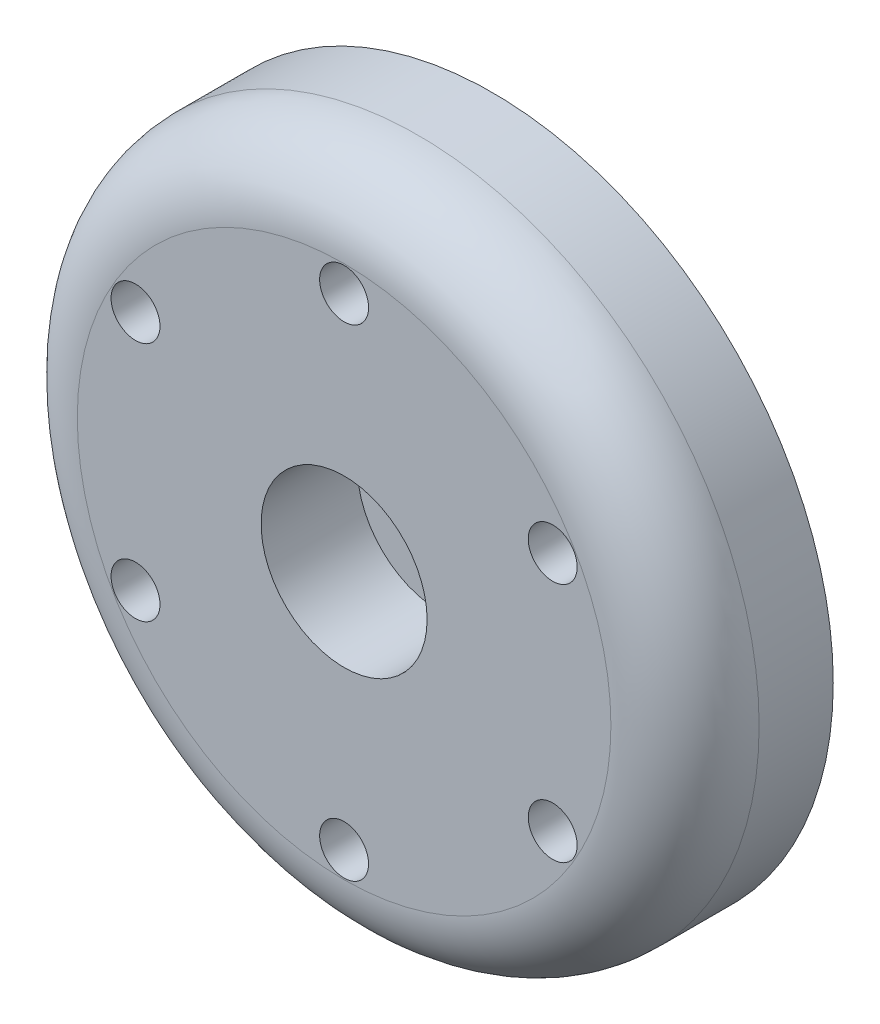
ISO-10303-21;
HEADER;
FILE_DESCRIPTION(('STEP AP214'),'2;1');
FILE_NAME('part.step','',(''),(''),'','','');
FILE_SCHEMA(('AUTOMOTIVE_DESIGN { 1 0 10303 214 1 1 1 1 }'));
ENDSEC;
DATA;
#1=APPLICATION_CONTEXT('core data for automotive mechanical design processes');
#2=APPLICATION_PROTOCOL_DEFINITION('international standard','automotive_design',2000,#1);
#3=PRODUCT_CONTEXT('',#1,'mechanical');
#4=PRODUCT('Part','Part','',(#3));
#5=PRODUCT_RELATED_PRODUCT_CATEGORY('part','',(#4));
#6=PRODUCT_DEFINITION_FORMATION('','',#4);
#7=PRODUCT_DEFINITION_CONTEXT('part definition',#1,'design');
#8=PRODUCT_DEFINITION('design','',#6,#7);
#9=PRODUCT_DEFINITION_SHAPE('','',#8);
#10=(LENGTH_UNIT() NAMED_UNIT(*) SI_UNIT(.MILLI.,.METRE.));
#11=(NAMED_UNIT(*) PLANE_ANGLE_UNIT() SI_UNIT($,.RADIAN.));
#12=(NAMED_UNIT(*) SI_UNIT($,.STERADIAN.) SOLID_ANGLE_UNIT());
#13=UNCERTAINTY_MEASURE_WITH_UNIT(LENGTH_MEASURE(1.E-05),#10,'distance_accuracy_value','');
#14=(GEOMETRIC_REPRESENTATION_CONTEXT(3) GLOBAL_UNCERTAINTY_ASSIGNED_CONTEXT((#13)) GLOBAL_UNIT_ASSIGNED_CONTEXT((#10,
#11,#12)) REPRESENTATION_CONTEXT('',''));
#15=CARTESIAN_POINT('',(0.,0.,0.));
#16=DIRECTION('',(0.,0.,1.));
#17=DIRECTION('',(1.,0.,0.));
#18=AXIS2_PLACEMENT_3D('',#15,#16,#17);
#19=CARTESIAN_POINT('',(0.,0.,10.));
#20=DIRECTION('',(0.,0.,-1.));
#21=DIRECTION('',(-1.,0.,0.));
#22=AXIS2_PLACEMENT_3D('',#19,#20,#21);
#23=CYLINDRICAL_SURFACE('',#22,23.);
#24=CARTESIAN_POINT('',(0.,0.,5.));
#25=DIRECTION('',(0.,0.,1.));
#26=DIRECTION('',(1.,0.,0.));
#27=AXIS2_PLACEMENT_3D('',#24,#25,#26);
#28=CIRCLE('',#27,23.);
#29=CARTESIAN_POINT('',(23.,0.,5.));
#30=VERTEX_POINT('',#29);
#31=EDGE_CURVE('E37',#30,#30,#28,.F.);
#32=ORIENTED_EDGE('',*,*,#31,.T.);
#33=EDGE_LOOP('',(#32));
#34=FACE_BOUND('',#33,.T.);
#35=CARTESIAN_POINT('',(0.,0.,0.));
#36=DIRECTION('',(0.,0.,-1.));
#37=DIRECTION('',(-1.,0.,0.));
#38=AXIS2_PLACEMENT_3D('',#35,#36,#37);
#39=CIRCLE('',#38,23.);
#40=CARTESIAN_POINT('',(-23.,0.,0.));
#41=VERTEX_POINT('',#40);
#42=EDGE_CURVE('E41',#41,#41,#39,.T.);
#43=ORIENTED_EDGE('',*,*,#42,.F.);
#44=EDGE_LOOP('',(#43));
#45=FACE_BOUND('',#44,.T.);
#46=ADVANCED_FACE('F30',(#34,#45),#23,.T.);
#47=CARTESIAN_POINT('',(23.,0.,10.));
#48=DIRECTION('',(0.,0.,1.));
#49=DIRECTION('',(1.,0.,0.));
#50=AXIS2_PLACEMENT_3D('',#47,#48,#49);
#51=PLANE('',#50);
#52=CARTESIAN_POINT('',(0.,0.,10.));
#53=DIRECTION('',(0.,0.,1.));
#54=DIRECTION('',(1.,0.,0.));
#55=AXIS2_PLACEMENT_3D('',#52,#53,#54);
#56=CIRCLE('',#55,18.);
#57=CARTESIAN_POINT('',(18.,0.,10.));
#58=VERTEX_POINT('',#57);
#59=EDGE_CURVE('E10',#58,#58,#56,.T.);
#60=ORIENTED_EDGE('',*,*,#59,.T.);
#61=EDGE_LOOP('',(#60));
#62=FACE_BOUND('',#61,.T.);
#63=CARTESIAN_POINT('',(0.,0.,10.));
#64=DIRECTION('',(0.,0.,1.));
#65=DIRECTION('',(1.,0.,0.));
#66=AXIS2_PLACEMENT_3D('',#63,#64,#65);
#67=CIRCLE('',#66,5.59999999999999);
#68=CARTESIAN_POINT('',(5.59999999999999,0.,10.));
#69=VERTEX_POINT('',#68);
#70=EDGE_CURVE('E104',#69,#69,#67,.T.);
#71=ORIENTED_EDGE('',*,*,#70,.F.);
#72=EDGE_LOOP('',(#71));
#73=FACE_BOUND('',#72,.T.);
#74=CARTESIAN_POINT('',(14.072912811497,8.12500000000017,10.));
#75=DIRECTION('',(0.,0.,1.));
#76=DIRECTION('',(1.,0.,0.));
#77=AXIS2_PLACEMENT_3D('',#74,#75,#76);
#78=CIRCLE('',#77,1.64999999999999);
#79=CARTESIAN_POINT('',(15.722912811497,8.12500000000017,10.));
#80=VERTEX_POINT('',#79);
#81=EDGE_CURVE('E52',#80,#80,#78,.T.);
#82=ORIENTED_EDGE('',*,*,#81,.F.);
#83=EDGE_LOOP('',(#82));
#84=FACE_BOUND('',#83,.T.);
#85=CARTESIAN_POINT('',(14.0729128114971,-8.12500000000001,10.));
#86=DIRECTION('',(0.,0.,1.));
#87=DIRECTION('',(1.,0.,0.));
#88=AXIS2_PLACEMENT_3D('',#85,#86,#87);
#89=CIRCLE('',#88,1.64999999999999);
#90=CARTESIAN_POINT('',(15.7229128114971,-8.12500000000001,10.));
#91=VERTEX_POINT('',#90);
#92=EDGE_CURVE('E51',#91,#91,#89,.T.);
#93=ORIENTED_EDGE('',*,*,#92,.F.);
#94=EDGE_LOOP('',(#93));
#95=FACE_BOUND('',#94,.T.);
#96=CARTESIAN_POINT('',(1.13473143512402E-13,-16.25,10.));
#97=DIRECTION('',(0.,0.,1.));
#98=DIRECTION('',(1.,0.,0.));
#99=AXIS2_PLACEMENT_3D('',#96,#97,#98);
#100=CIRCLE('',#99,1.64999999999999);
#101=CARTESIAN_POINT('',(1.6500000000001,-16.25,10.));
#102=VERTEX_POINT('',#101);
#103=EDGE_CURVE('E56',#102,#102,#100,.T.);
#104=ORIENTED_EDGE('',*,*,#103,.F.);
#105=EDGE_LOOP('',(#104));
#106=FACE_BOUND('',#105,.T.);
#107=CARTESIAN_POINT('',(-14.0729128114971,-8.12500000000007,10.));
#108=DIRECTION('',(0.,0.,1.));
#109=DIRECTION('',(1.,0.,0.));
#110=AXIS2_PLACEMENT_3D('',#107,#108,#109);
#111=CIRCLE('',#110,1.64999999999999);
#112=CARTESIAN_POINT('',(-12.4229128114971,-8.12500000000007,10.));
#113=VERTEX_POINT('',#112);
#114=EDGE_CURVE('E60',#113,#113,#111,.T.);
#115=ORIENTED_EDGE('',*,*,#114,.F.);
#116=EDGE_LOOP('',(#115));
#117=FACE_BOUND('',#116,.T.);
#118=CARTESIAN_POINT('',(-14.0729128114972,8.12499999999998,10.));
#119=DIRECTION('',(0.,0.,1.));
#120=DIRECTION('',(1.,0.,0.));
#121=AXIS2_PLACEMENT_3D('',#118,#119,#120);
#122=CIRCLE('',#121,1.64999999999999);
#123=CARTESIAN_POINT('',(-12.4229128114972,8.12499999999998,10.));
#124=VERTEX_POINT('',#123);
#125=EDGE_CURVE('E64',#124,#124,#122,.T.);
#126=ORIENTED_EDGE('',*,*,#125,.F.);
#127=EDGE_LOOP('',(#126));
#128=FACE_BOUND('',#127,.T.);
#129=CARTESIAN_POINT('',(0.,16.25,10.));
#130=DIRECTION('',(0.,0.,1.));
#131=DIRECTION('',(1.,0.,0.));
#132=AXIS2_PLACEMENT_3D('',#129,#130,#131);
#133=CIRCLE('',#132,1.64999999999999);
#134=CARTESIAN_POINT('',(1.64999999999999,16.25,10.));
#135=VERTEX_POINT('',#134);
#136=EDGE_CURVE('E68',#135,#135,#133,.T.);
#137=ORIENTED_EDGE('',*,*,#136,.F.);
#138=EDGE_LOOP('',(#137));
#139=FACE_BOUND('',#138,.T.);
#140=ADVANCED_FACE('F110',(#62,#73,#84,#95,#106,#117,#128,#139),#51,.T.);
#141=CARTESIAN_POINT('',(0.,0.,0.));
#142=DIRECTION('',(0.,0.,-1.));
#143=DIRECTION('',(-1.,0.,0.));
#144=AXIS2_PLACEMENT_3D('',#141,#142,#143);
#145=PLANE('',#144);
#146=CARTESIAN_POINT('',(0.,0.,0.));
#147=DIRECTION('',(0.,0.,-1.));
#148=DIRECTION('',(-1.,0.,0.));
#149=AXIS2_PLACEMENT_3D('',#146,#147,#148);
#150=CIRCLE('',#149,20.);
#151=CARTESIAN_POINT('',(-20.,0.,0.));
#152=VERTEX_POINT('',#151);
#153=EDGE_CURVE('E75',#152,#152,#150,.T.);
#154=ORIENTED_EDGE('',*,*,#153,.F.);
#155=EDGE_LOOP('',(#154));
#156=FACE_BOUND('',#155,.T.);
#157=ORIENTED_EDGE('',*,*,#42,.T.);
#158=EDGE_LOOP('',(#157));
#159=FACE_BOUND('',#158,.T.);
#160=ADVANCED_FACE('F113',(#156,#159),#145,.T.);
#161=CARTESIAN_POINT('',(0.,0.,5.8));
#162=DIRECTION('',(0.,0.,1.));
#163=DIRECTION('',(1.,0.,0.));
#164=AXIS2_PLACEMENT_3D('',#161,#162,#163);
#165=PLANE('',#164);
#166=CARTESIAN_POINT('',(14.072912811497,8.12500000000017,5.8));
#167=DIRECTION('',(0.,0.,1.));
#168=DIRECTION('',(1.,0.,0.));
#169=AXIS2_PLACEMENT_3D('',#166,#167,#168);
#170=CIRCLE('',#169,1.64999999999999);
#171=CARTESIAN_POINT('',(15.722912811497,8.12500000000017,5.8));
#172=VERTEX_POINT('',#171);
#173=EDGE_CURVE('E48',#172,#172,#170,.T.);
#174=ORIENTED_EDGE('',*,*,#173,.T.);
#175=EDGE_LOOP('',(#174));
#176=FACE_BOUND('',#175,.T.);
#177=CARTESIAN_POINT('',(14.0729128114971,-8.12500000000001,5.8));
#178=DIRECTION('',(0.,0.,1.));
#179=DIRECTION('',(1.,0.,0.));
#180=AXIS2_PLACEMENT_3D('',#177,#178,#179);
#181=CIRCLE('',#180,1.64999999999999);
#182=CARTESIAN_POINT('',(15.7229128114971,-8.12500000000001,5.8));
#183=VERTEX_POINT('',#182);
#184=EDGE_CURVE('E53',#183,#183,#181,.T.);
#185=ORIENTED_EDGE('',*,*,#184,.T.);
#186=EDGE_LOOP('',(#185));
#187=FACE_BOUND('',#186,.T.);
#188=CARTESIAN_POINT('',(1.13473143512402E-13,-16.25,5.8));
#189=DIRECTION('',(0.,0.,1.));
#190=DIRECTION('',(1.,0.,0.));
#191=AXIS2_PLACEMENT_3D('',#188,#189,#190);
#192=CIRCLE('',#191,1.64999999999999);
#193=CARTESIAN_POINT('',(1.6500000000001,-16.25,5.8));
#194=VERTEX_POINT('',#193);
#195=EDGE_CURVE('E57',#194,#194,#192,.T.);
#196=ORIENTED_EDGE('',*,*,#195,.T.);
#197=EDGE_LOOP('',(#196));
#198=FACE_BOUND('',#197,.T.);
#199=CARTESIAN_POINT('',(-14.0729128114971,-8.12500000000007,5.8));
#200=DIRECTION('',(0.,0.,1.));
#201=DIRECTION('',(1.,0.,0.));
#202=AXIS2_PLACEMENT_3D('',#199,#200,#201);
#203=CIRCLE('',#202,1.64999999999999);
#204=CARTESIAN_POINT('',(-12.4229128114971,-8.12500000000007,5.8));
#205=VERTEX_POINT('',#204);
#206=EDGE_CURVE('E61',#205,#205,#203,.T.);
#207=ORIENTED_EDGE('',*,*,#206,.T.);
#208=EDGE_LOOP('',(#207));
#209=FACE_BOUND('',#208,.T.);
#210=CARTESIAN_POINT('',(-14.0729128114972,8.12499999999998,5.8));
#211=DIRECTION('',(0.,0.,1.));
#212=DIRECTION('',(1.,0.,0.));
#213=AXIS2_PLACEMENT_3D('',#210,#211,#212);
#214=CIRCLE('',#213,1.64999999999999);
#215=CARTESIAN_POINT('',(-12.4229128114972,8.12499999999998,5.8));
#216=VERTEX_POINT('',#215);
#217=EDGE_CURVE('E65',#216,#216,#214,.T.);
#218=ORIENTED_EDGE('',*,*,#217,.T.);
#219=EDGE_LOOP('',(#218));
#220=FACE_BOUND('',#219,.T.);
#221=CARTESIAN_POINT('',(0.,16.25,5.8));
#222=DIRECTION('',(0.,0.,1.));
#223=DIRECTION('',(1.,0.,0.));
#224=AXIS2_PLACEMENT_3D('',#221,#222,#223);
#225=CIRCLE('',#224,1.64999999999999);
#226=CARTESIAN_POINT('',(1.64999999999999,16.25,5.8));
#227=VERTEX_POINT('',#226);
#228=EDGE_CURVE('E69',#227,#227,#225,.T.);
#229=ORIENTED_EDGE('',*,*,#228,.T.);
#230=EDGE_LOOP('',(#229));
#231=FACE_BOUND('',#230,.T.);
#232=CARTESIAN_POINT('',(0.,0.,5.8));
#233=DIRECTION('',(0.,0.,-1.));
#234=DIRECTION('',(-1.,0.,0.));
#235=AXIS2_PLACEMENT_3D('',#232,#233,#234);
#236=CIRCLE('',#235,12.5);
#237=CARTESIAN_POINT('',(-12.5,0.,5.8));
#238=VERTEX_POINT('',#237);
#239=EDGE_CURVE('E78',#238,#238,#236,.T.);
#240=ORIENTED_EDGE('',*,*,#239,.F.);
#241=EDGE_LOOP('',(#240));
#242=FACE_BOUND('',#241,.T.);
#243=CARTESIAN_POINT('',(0.,0.,5.8));
#244=DIRECTION('',(0.,0.,-1.));
#245=DIRECTION('',(-1.,0.,0.));
#246=AXIS2_PLACEMENT_3D('',#243,#244,#245);
#247=CIRCLE('',#246,20.);
#248=CARTESIAN_POINT('',(-20.,0.,5.8));
#249=VERTEX_POINT('',#248);
#250=EDGE_CURVE('E45',#249,#249,#247,.T.);
#251=ORIENTED_EDGE('',*,*,#250,.T.);
#252=EDGE_LOOP('',(#251));
#253=FACE_BOUND('',#252,.T.);
#254=ADVANCED_FACE('F135',(#176,#187,#198,#209,#220,#231,#242,#253),#165,.F.);
#255=CARTESIAN_POINT('',(0.,0.,0.));
#256=DIRECTION('',(0.,0.,-1.));
#257=DIRECTION('',(-1.,0.,0.));
#258=AXIS2_PLACEMENT_3D('',#255,#256,#257);
#259=CYLINDRICAL_SURFACE('',#258,20.);
#260=ORIENTED_EDGE('',*,*,#250,.F.);
#261=EDGE_LOOP('',(#260));
#262=FACE_BOUND('',#261,.T.);
#263=ORIENTED_EDGE('',*,*,#153,.T.);
#264=EDGE_LOOP('',(#263));
#265=FACE_BOUND('',#264,.T.);
#266=ADVANCED_FACE('F138',(#262,#265),#259,.F.);
#267=CARTESIAN_POINT('',(0.,0.,5.8));
#268=DIRECTION('',(0.,0.,-1.));
#269=DIRECTION('',(-1.,0.,0.));
#270=AXIS2_PLACEMENT_3D('',#267,#268,#269);
#271=CYLINDRICAL_SURFACE('',#270,12.5);
#272=ORIENTED_EDGE('',*,*,#239,.T.);
#273=EDGE_LOOP('',(#272));
#274=FACE_BOUND('',#273,.T.);
#275=CARTESIAN_POINT('',(0.,0.,0.));
#276=DIRECTION('',(0.,0.,-1.));
#277=DIRECTION('',(-1.,0.,0.));
#278=AXIS2_PLACEMENT_3D('',#275,#276,#277);
#279=CIRCLE('',#278,12.5);
#280=CARTESIAN_POINT('',(-12.5,0.,0.));
#281=VERTEX_POINT('',#280);
#282=EDGE_CURVE('E71',#281,#281,#279,.T.);
#283=ORIENTED_EDGE('',*,*,#282,.F.);
#284=EDGE_LOOP('',(#283));
#285=FACE_BOUND('',#284,.T.);
#286=ADVANCED_FACE('F147',(#274,#285),#271,.T.);
#287=CARTESIAN_POINT('',(0.,0.,0.));
#288=DIRECTION('',(0.,0.,-1.));
#289=DIRECTION('',(-1.,0.,0.));
#290=AXIS2_PLACEMENT_3D('',#287,#288,#289);
#291=PLANE('',#290);
#292=CARTESIAN_POINT('',(0.,0.,0.));
#293=DIRECTION('',(0.,0.,1.));
#294=DIRECTION('',(1.,0.,0.));
#295=AXIS2_PLACEMENT_3D('',#292,#293,#294);
#296=CIRCLE('',#295,3.02250000000001);
#297=CARTESIAN_POINT('',(3.02250000000001,0.,0.));
#298=VERTEX_POINT('',#297);
#299=EDGE_CURVE('E95',#298,#298,#296,.T.);
#300=ORIENTED_EDGE('',*,*,#299,.T.);
#301=EDGE_LOOP('',(#300));
#302=FACE_BOUND('',#301,.T.);
#303=ORIENTED_EDGE('',*,*,#282,.T.);
#304=EDGE_LOOP('',(#303));
#305=FACE_BOUND('',#304,.T.);
#306=ADVANCED_FACE('F131',(#302,#305),#291,.T.);
#307=CARTESIAN_POINT('',(0.,16.25,10.));
#308=DIRECTION('',(0.,0.,1.));
#309=DIRECTION('',(1.,0.,0.));
#310=AXIS2_PLACEMENT_3D('',#307,#308,#309);
#311=CYLINDRICAL_SURFACE('',#310,1.64999999999999);
#312=ORIENTED_EDGE('',*,*,#136,.T.);
#313=EDGE_LOOP('',(#312));
#314=FACE_BOUND('',#313,.T.);
#315=ORIENTED_EDGE('',*,*,#228,.F.);
#316=EDGE_LOOP('',(#315));
#317=FACE_BOUND('',#316,.T.);
#318=ADVANCED_FACE('F127',(#314,#317),#311,.F.);
#319=CARTESIAN_POINT('',(-14.0729128114972,8.12499999999998,10.));
#320=DIRECTION('',(0.,0.,1.));
#321=DIRECTION('',(1.,0.,0.));
#322=AXIS2_PLACEMENT_3D('',#319,#320,#321);
#323=CYLINDRICAL_SURFACE('',#322,1.64999999999999);
#324=ORIENTED_EDGE('',*,*,#125,.T.);
#325=EDGE_LOOP('',(#324));
#326=FACE_BOUND('',#325,.T.);
#327=ORIENTED_EDGE('',*,*,#217,.F.);
#328=EDGE_LOOP('',(#327));
#329=FACE_BOUND('',#328,.T.);
#330=ADVANCED_FACE('F130',(#326,#329),#323,.F.);
#331=CARTESIAN_POINT('',(-14.0729128114971,-8.12500000000007,10.));
#332=DIRECTION('',(0.,0.,1.));
#333=DIRECTION('',(1.,0.,0.));
#334=AXIS2_PLACEMENT_3D('',#331,#332,#333);
#335=CYLINDRICAL_SURFACE('',#334,1.64999999999999);
#336=ORIENTED_EDGE('',*,*,#114,.T.);
#337=EDGE_LOOP('',(#336));
#338=FACE_BOUND('',#337,.T.);
#339=ORIENTED_EDGE('',*,*,#206,.F.);
#340=EDGE_LOOP('',(#339));
#341=FACE_BOUND('',#340,.T.);
#342=ADVANCED_FACE('F168',(#338,#341),#335,.F.);
#343=CARTESIAN_POINT('',(1.13473143512402E-13,-16.25,10.));
#344=DIRECTION('',(0.,0.,1.));
#345=DIRECTION('',(1.,0.,0.));
#346=AXIS2_PLACEMENT_3D('',#343,#344,#345);
#347=CYLINDRICAL_SURFACE('',#346,1.64999999999999);
#348=ORIENTED_EDGE('',*,*,#103,.T.);
#349=EDGE_LOOP('',(#348));
#350=FACE_BOUND('',#349,.T.);
#351=ORIENTED_EDGE('',*,*,#195,.F.);
#352=EDGE_LOOP('',(#351));
#353=FACE_BOUND('',#352,.T.);
#354=ADVANCED_FACE('F172',(#350,#353),#347,.F.);
#355=CARTESIAN_POINT('',(14.0729128114971,-8.12500000000001,10.));
#356=DIRECTION('',(0.,0.,1.));
#357=DIRECTION('',(1.,0.,0.));
#358=AXIS2_PLACEMENT_3D('',#355,#356,#357);
#359=CYLINDRICAL_SURFACE('',#358,1.64999999999999);
#360=ORIENTED_EDGE('',*,*,#92,.T.);
#361=EDGE_LOOP('',(#360));
#362=FACE_BOUND('',#361,.T.);
#363=ORIENTED_EDGE('',*,*,#184,.F.);
#364=EDGE_LOOP('',(#363));
#365=FACE_BOUND('',#364,.T.);
#366=ADVANCED_FACE('F176',(#362,#365),#359,.F.);
#367=CARTESIAN_POINT('',(14.072912811497,8.12500000000017,10.));
#368=DIRECTION('',(0.,0.,1.));
#369=DIRECTION('',(1.,0.,0.));
#370=AXIS2_PLACEMENT_3D('',#367,#368,#369);
#371=CYLINDRICAL_SURFACE('',#370,1.64999999999999);
#372=ORIENTED_EDGE('',*,*,#81,.T.);
#373=EDGE_LOOP('',(#372));
#374=FACE_BOUND('',#373,.T.);
#375=ORIENTED_EDGE('',*,*,#173,.F.);
#376=EDGE_LOOP('',(#375));
#377=FACE_BOUND('',#376,.T.);
#378=ADVANCED_FACE('F180',(#374,#377),#371,.F.);
#379=CARTESIAN_POINT('',(0.,0.,10.));
#380=DIRECTION('',(0.,0.,1.));
#381=DIRECTION('',(1.,0.,0.));
#382=AXIS2_PLACEMENT_3D('',#379,#380,#381);
#383=CYLINDRICAL_SURFACE('',#382,3.02250000000001);
#384=ORIENTED_EDGE('',*,*,#299,.F.);
#385=EDGE_LOOP('',(#384));
#386=FACE_BOUND('',#385,.T.);
#387=CARTESIAN_POINT('',(0.,0.,3.5));
#388=DIRECTION('',(0.,0.,1.));
#389=DIRECTION('',(1.,0.,0.));
#390=AXIS2_PLACEMENT_3D('',#387,#388,#389);
#391=CIRCLE('',#390,3.02250000000001);
#392=CARTESIAN_POINT('',(3.02250000000001,0.,3.5));
#393=VERTEX_POINT('',#392);
#394=EDGE_CURVE('E98',#393,#393,#391,.T.);
#395=ORIENTED_EDGE('',*,*,#394,.T.);
#396=EDGE_LOOP('',(#395));
#397=FACE_BOUND('',#396,.T.);
#398=ADVANCED_FACE('F184',(#386,#397),#383,.F.);
#399=CARTESIAN_POINT('',(3.02250000000001,0.,3.5));
#400=DIRECTION('',(0.,0.,-1.));
#401=DIRECTION('',(-1.,0.,0.));
#402=AXIS2_PLACEMENT_3D('',#399,#400,#401);
#403=PLANE('',#402);
#404=ORIENTED_EDGE('',*,*,#394,.F.);
#405=EDGE_LOOP('',(#404));
#406=FACE_BOUND('',#405,.T.);
#407=CARTESIAN_POINT('',(0.,0.,3.5));
#408=DIRECTION('',(0.,0.,1.));
#409=DIRECTION('',(1.,0.,0.));
#410=AXIS2_PLACEMENT_3D('',#407,#408,#409);
#411=CIRCLE('',#410,5.59999999999999);
#412=CARTESIAN_POINT('',(5.59999999999999,0.,3.5));
#413=VERTEX_POINT('',#412);
#414=EDGE_CURVE('E101',#413,#413,#411,.T.);
#415=ORIENTED_EDGE('',*,*,#414,.T.);
#416=EDGE_LOOP('',(#415));
#417=FACE_BOUND('',#416,.T.);
#418=ADVANCED_FACE('F188',(#406,#417),#403,.F.);
#419=CARTESIAN_POINT('',(0.,0.,10.));
#420=DIRECTION('',(0.,0.,1.));
#421=DIRECTION('',(1.,0.,0.));
#422=AXIS2_PLACEMENT_3D('',#419,#420,#421);
#423=CYLINDRICAL_SURFACE('',#422,5.59999999999999);
#424=ORIENTED_EDGE('',*,*,#414,.F.);
#425=EDGE_LOOP('',(#424));
#426=FACE_BOUND('',#425,.T.);
#427=ORIENTED_EDGE('',*,*,#70,.T.);
#428=EDGE_LOOP('',(#427));
#429=FACE_BOUND('',#428,.T.);
#430=ADVANCED_FACE('F108',(#426,#429),#423,.F.);
#431=CARTESIAN_POINT('',(0.,0.,5.));
#432=DIRECTION('',(0.,0.,1.));
#433=DIRECTION('',(1.,0.,0.));
#434=AXIS2_PLACEMENT_3D('',#431,#432,#433);
#435=TOROIDAL_SURFACE('',#434,18.,5.);
#436=ORIENTED_EDGE('',*,*,#59,.F.);
#437=EDGE_LOOP('',(#436));
#438=FACE_BOUND('',#437,.T.);
#439=ORIENTED_EDGE('',*,*,#31,.F.);
#440=EDGE_LOOP('',(#439));
#441=FACE_BOUND('',#440,.T.);
#442=ADVANCED_FACE('F32',(#438,#441),#435,.T.);
#443=CLOSED_SHELL('',(#46,#140,#160,#254,#266,#286,#306,#318,#330,#342,#354,#366,#378,#398,#418,
#430,#442));
#444=MANIFOLD_SOLID_BREP('B2',#443);
#445=ADVANCED_BREP_SHAPE_REPRESENTATION('',(#18,#444),#14);
#446=SHAPE_DEFINITION_REPRESENTATION(#9,#445);
ENDSEC;
END-ISO-10303-21;
